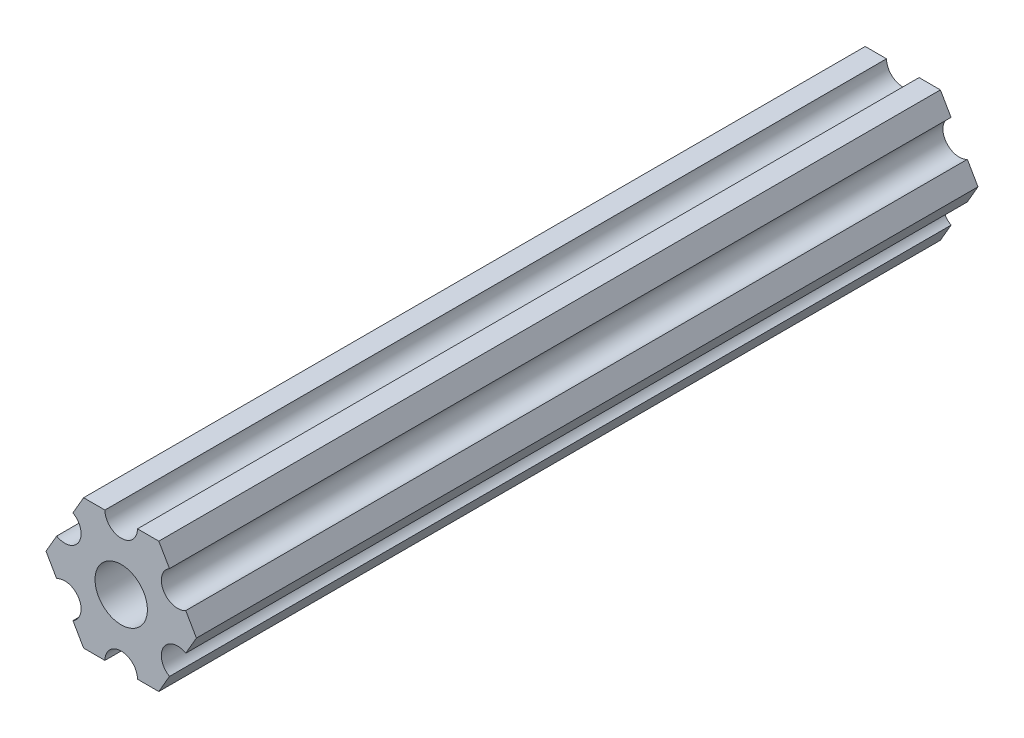
ISO-10303-21;
HEADER;
FILE_DESCRIPTION(('STEP AP214'),'2;1');
FILE_NAME('part.step','',(''),(''),'','','');
FILE_SCHEMA(('AUTOMOTIVE_DESIGN { 1 0 10303 214 1 1 1 1 }'));
ENDSEC;
DATA;
#1=APPLICATION_CONTEXT('core data for automotive mechanical design processes');
#2=APPLICATION_PROTOCOL_DEFINITION('international standard','automotive_design',2000,#1);
#3=PRODUCT_CONTEXT('',#1,'mechanical');
#4=PRODUCT('Part','Part','',(#3));
#5=PRODUCT_RELATED_PRODUCT_CATEGORY('part','',(#4));
#6=PRODUCT_DEFINITION_FORMATION('','',#4);
#7=PRODUCT_DEFINITION_CONTEXT('part definition',#1,'design');
#8=PRODUCT_DEFINITION('design','',#6,#7);
#9=PRODUCT_DEFINITION_SHAPE('','',#8);
#10=(LENGTH_UNIT() NAMED_UNIT(*) SI_UNIT(.MILLI.,.METRE.));
#11=(NAMED_UNIT(*) PLANE_ANGLE_UNIT() SI_UNIT($,.RADIAN.));
#12=(NAMED_UNIT(*) SI_UNIT($,.STERADIAN.) SOLID_ANGLE_UNIT());
#13=UNCERTAINTY_MEASURE_WITH_UNIT(LENGTH_MEASURE(1.E-05),#10,'distance_accuracy_value','');
#14=(GEOMETRIC_REPRESENTATION_CONTEXT(3) GLOBAL_UNCERTAINTY_ASSIGNED_CONTEXT((#13)) GLOBAL_UNIT_ASSIGNED_CONTEXT((#10,
#11,#12)) REPRESENTATION_CONTEXT('',''));
#15=CARTESIAN_POINT('',(0.,0.,0.));
#16=DIRECTION('',(0.,0.,1.));
#17=DIRECTION('',(1.,0.,0.));
#18=AXIS2_PLACEMENT_3D('',#15,#16,#17);
#19=CARTESIAN_POINT('',(-5.49926150638083,-3.17499966684068,0.));
#20=DIRECTION('',(0.,0.,-1.));
#21=DIRECTION('',(-1.,0.,0.));
#22=AXIS2_PLACEMENT_3D('',#19,#20,#21);
#23=PLANE('',#22);
#24=CARTESIAN_POINT('',(-5.49926150638083,-3.17499966684068,0.));
#25=DIRECTION('',(0.,0.,-1.));
#26=DIRECTION('',(-1.,0.,0.));
#27=AXIS2_PLACEMENT_3D('',#24,#25,#26);
#28=CIRCLE('',#27,1.58750000000001);
#29=CARTESIAN_POINT('',(-6.29301142309098,-1.80018429024546,0.));
#30=VERTEX_POINT('',#29);
#31=CARTESIAN_POINT('',(-4.70551158967068,-4.54981504343589,0.));
#32=VERTEX_POINT('',#31);
#33=EDGE_CURVE('E203',#30,#32,#28,.T.);
#34=ORIENTED_EDGE('',*,*,#33,.T.);
#35=DIRECTION('',(0.499999947533953,-0.866025434075723,0.));
#36=VECTOR('',#35,1.);
#37=CARTESIAN_POINT('',(-4.70551158967068,-4.54981504343589,0.));
#38=LINE('',#37,#36);
#39=CARTESIAN_POINT('',(-3.66617452134693,-6.34999990382519,0.));
#40=VERTEX_POINT('',#39);
#41=EDGE_CURVE('E206',#32,#40,#38,.T.);
#42=ORIENTED_EDGE('',*,*,#41,.T.);
#43=DIRECTION('',(1.,0.,0.));
#44=VECTOR('',#43,1.);
#45=CARTESIAN_POINT('',(-3.66617452134693,-6.34999990382519,0.));
#46=LINE('',#45,#44);
#47=CARTESIAN_POINT('',(-1.58750230819557,-6.34999990382519,0.));
#48=VERTEX_POINT('',#47);
#49=EDGE_CURVE('E210',#40,#48,#46,.T.);
#50=ORIENTED_EDGE('',*,*,#49,.T.);
#51=CARTESIAN_POINT('',(-3.8469926204343E-07,-6.34999990382519,0.));
#52=DIRECTION('',(0.,0.,-1.));
#53=DIRECTION('',(-1.,0.,0.));
#54=AXIS2_PLACEMENT_3D('',#51,#52,#53);
#55=CIRCLE('',#54,1.58750192349631);
#56=CARTESIAN_POINT('',(1.58750192349631,-6.34999990382519,0.));
#57=VERTEX_POINT('',#56);
#58=EDGE_CURVE('E213',#48,#57,#55,.T.);
#59=ORIENTED_EDGE('',*,*,#58,.T.);
#60=DIRECTION('',(1.,0.,0.));
#61=VECTOR('',#60,1.);
#62=CARTESIAN_POINT('',(1.58750192349631,-6.34999990382519,0.));
#63=LINE('',#62,#61);
#64=CARTESIAN_POINT('',(3.66617382465481,-6.34999990382519,0.));
#65=VERTEX_POINT('',#64);
#66=EDGE_CURVE('E216',#57,#65,#63,.T.);
#67=ORIENTED_EDGE('',*,*,#66,.T.);
#68=DIRECTION('',(0.5,0.866025403784439,0.));
#69=VECTOR('',#68,1.);
#70=CARTESIAN_POINT('',(3.66617382465481,-6.34999990382519,0.));
#71=LINE('',#70,#69);
#72=CARTESIAN_POINT('',(4.70551092933191,-4.54981523233291,0.));
#73=VERTEX_POINT('',#72);
#74=EDGE_CURVE('E219',#65,#73,#71,.T.);
#75=ORIENTED_EDGE('',*,*,#74,.T.);
#76=CARTESIAN_POINT('',(5.49926092933191,-3.17499990382512,0.));
#77=DIRECTION('',(0.,0.,-1.));
#78=DIRECTION('',(-1.,0.,0.));
#79=AXIS2_PLACEMENT_3D('',#76,#77,#78);
#80=CIRCLE('',#79,1.5875);
#81=CARTESIAN_POINT('',(6.29301092933191,-1.80018457531732,0.));
#82=VERTEX_POINT('',#81);
#83=EDGE_CURVE('E222',#73,#82,#80,.T.);
#84=ORIENTED_EDGE('',*,*,#83,.T.);
#85=DIRECTION('',(0.5,0.866025403784438,0.));
#86=VECTOR('',#85,1.);
#87=CARTESIAN_POINT('',(6.29301092933191,-1.80018457531732,0.));
#88=LINE('',#87,#86);
#89=CARTESIAN_POINT('',(7.33234803400895,9.61748368946088E-08,0.));
#90=VERTEX_POINT('',#89);
#91=EDGE_CURVE('E225',#82,#90,#88,.T.);
#92=ORIENTED_EDGE('',*,*,#91,.T.);
#93=DIRECTION('',(-0.499999921300922,0.866025449221368,0.));
#94=VECTOR('',#93,1.);
#95=CARTESIAN_POINT('',(7.33234803400895,9.61748368946088E-08,0.));
#96=LINE('',#95,#94);
#97=CARTESIAN_POINT('',(6.29301117773375,1.80018471521667,0.));
#98=VERTEX_POINT('',#97);
#99=EDGE_CURVE('E228',#90,#98,#96,.T.);
#100=ORIENTED_EDGE('',*,*,#99,.T.);
#101=CARTESIAN_POINT('',(5.49926130266854,3.1750001158556,0.));
#102=DIRECTION('',(0.,0.,-1.));
#103=DIRECTION('',(-1.,0.,0.));
#104=AXIS2_PLACEMENT_3D('',#101,#102,#103);
#105=CIRCLE('',#104,1.5875);
#106=CARTESIAN_POINT('',(4.70551142760333,4.54981551649452,0.));
#107=VERTEX_POINT('',#106);
#108=EDGE_CURVE('E231',#98,#107,#105,.T.);
#109=ORIENTED_EDGE('',*,*,#108,.T.);
#110=DIRECTION('',(-0.499999921300922,0.866025449221368,0.));
#111=VECTOR('',#110,1.);
#112=CARTESIAN_POINT('',(4.70551142760333,4.54981551649452,0.));
#113=LINE('',#112,#111);
#114=CARTESIAN_POINT('',(3.66617452134701,6.35000022210623,0.));
#115=VERTEX_POINT('',#114);
#116=EDGE_CURVE('E234',#107,#115,#113,.T.);
#117=ORIENTED_EDGE('',*,*,#116,.T.);
#118=DIRECTION('',(-1.,0.,0.));
#119=VECTOR('',#118,1.);
#120=CARTESIAN_POINT('',(3.66617452134701,6.35000022210623,0.));
#121=LINE('',#120,#119);
#122=CARTESIAN_POINT('',(1.58749846120262,6.35000022210623,0.));
#123=VERTEX_POINT('',#122);
#124=EDGE_CURVE('E237',#115,#123,#121,.T.);
#125=ORIENTED_EDGE('',*,*,#124,.T.);
#126=CARTESIAN_POINT('',(3.84699344941095E-07,6.35000022210623,0.));
#127=DIRECTION('',(0.,0.,-1.));
#128=DIRECTION('',(-1.,0.,0.));
#129=AXIS2_PLACEMENT_3D('',#126,#127,#128);
#130=CIRCLE('',#129,1.58749807650328);
#131=CARTESIAN_POINT('',(-1.58749807650328,6.35000022210623,0.));
#132=VERTEX_POINT('',#131);
#133=EDGE_CURVE('E240',#123,#132,#130,.T.);
#134=ORIENTED_EDGE('',*,*,#133,.T.);
#135=DIRECTION('',(-1.,0.,0.));
#136=VECTOR('',#135,1.);
#137=CARTESIAN_POINT('',(-1.58749807650328,6.35000022210623,0.));
#138=LINE('',#137,#136);
#139=CARTESIAN_POINT('',(-3.66617382465472,6.35000022210622,0.));
#140=VERTEX_POINT('',#139);
#141=EDGE_CURVE('E243',#132,#140,#138,.T.);
#142=ORIENTED_EDGE('',*,*,#141,.T.);
#143=DIRECTION('',(-0.500000052466056,-0.866025373493145,0.));
#144=VECTOR('',#143,1.);
#145=CARTESIAN_POINT('',(-3.66617382465472,6.35000022210622,0.));
#146=LINE('',#145,#144);
#147=CARTESIAN_POINT('',(-4.70551103839166,4.54981561357968,0.));
#148=VERTEX_POINT('',#147);
#149=EDGE_CURVE('E246',#140,#148,#146,.T.);
#150=ORIENTED_EDGE('',*,*,#149,.T.);
#151=CARTESIAN_POINT('',(-5.49926112168152,3.17500033315931,0.));
#152=DIRECTION('',(0.,0.,-1.));
#153=DIRECTION('',(-1.,0.,0.));
#154=AXIS2_PLACEMENT_3D('',#151,#152,#153);
#155=CIRCLE('',#154,1.5875);
#156=CARTESIAN_POINT('',(-6.29301120497139,1.80018505273895,0.));
#157=VERTEX_POINT('',#156);
#158=EDGE_CURVE('E249',#148,#157,#155,.T.);
#159=ORIENTED_EDGE('',*,*,#158,.T.);
#160=DIRECTION('',(-0.500000052466056,-0.866025373493145,0.));
#161=VECTOR('',#160,1.);
#162=CARTESIAN_POINT('',(-6.29301120497139,1.80018505273895,0.));
#163=LINE('',#162,#161);
#164=CARTESIAN_POINT('',(-7.33234841870826,4.44212518856872E-07,0.));
#165=VERTEX_POINT('',#164);
#166=EDGE_CURVE('E180',#157,#165,#163,.T.);
#167=ORIENTED_EDGE('',*,*,#166,.T.);
#168=DIRECTION('',(0.499999947533953,-0.866025434075723,0.));
#169=VECTOR('',#168,1.);
#170=CARTESIAN_POINT('',(-7.33234841870826,4.44212518856872E-07,0.));
#171=LINE('',#170,#169);
#172=EDGE_CURVE('E252',#165,#30,#171,.T.);
#173=ORIENTED_EDGE('',*,*,#172,.T.);
#174=EDGE_LOOP('',(#34,#42,#50,#59,#67,#75,#84,#92,#100,#109,#117,#125,#134,#142,#150,#159,#167,#173));
#175=FACE_BOUND('',#174,.T.);
#176=CARTESIAN_POINT('',(0.,0.,0.));
#177=DIRECTION('',(0.,0.,1.));
#178=DIRECTION('',(1.,0.,0.));
#179=AXIS2_PLACEMENT_3D('',#176,#177,#178);
#180=CIRCLE('',#179,2.55269999999999);
#181=CARTESIAN_POINT('',(2.55269999999999,0.,0.));
#182=VERTEX_POINT('',#181);
#183=EDGE_CURVE('E313',#182,#182,#180,.T.);
#184=ORIENTED_EDGE('',*,*,#183,.F.);
#185=EDGE_LOOP('',(#184));
#186=FACE_BOUND('',#185,.T.);
#187=ADVANCED_FACE('F45',(#175,#186),#23,.F.);
#188=CARTESIAN_POINT('',(-5.49926150638083,-3.17499966684068,-76.2));
#189=DIRECTION('',(0.,0.,1.));
#190=DIRECTION('',(1.,0.,0.));
#191=AXIS2_PLACEMENT_3D('',#188,#189,#190);
#192=CYLINDRICAL_SURFACE('',#191,1.58750000000001);
#193=ORIENTED_EDGE('',*,*,#33,.F.);
#194=DIRECTION('',(0.,0.,1.));
#195=VECTOR('',#194,1.);
#196=CARTESIAN_POINT('',(-6.29301142309098,-1.80018429024546,-76.2));
#197=LINE('',#196,#195);
#198=CARTESIAN_POINT('',(-6.29301142309098,-1.80018429024546,-76.2));
#199=VERTEX_POINT('',#198);
#200=EDGE_CURVE('E11',#199,#30,#197,.T.);
#201=ORIENTED_EDGE('',*,*,#200,.F.);
#202=CARTESIAN_POINT('',(-5.49926150638083,-3.17499966684068,-76.2));
#203=DIRECTION('',(0.,0.,-1.));
#204=DIRECTION('',(-1.,0.,0.));
#205=AXIS2_PLACEMENT_3D('',#202,#203,#204);
#206=CIRCLE('',#205,1.58750000000001);
#207=CARTESIAN_POINT('',(-4.70551158967068,-4.54981504343589,-76.2));
#208=VERTEX_POINT('',#207);
#209=EDGE_CURVE('E254',#199,#208,#206,.T.);
#210=ORIENTED_EDGE('',*,*,#209,.T.);
#211=DIRECTION('',(0.,0.,1.));
#212=VECTOR('',#211,1.);
#213=CARTESIAN_POINT('',(-4.70551158967068,-4.54981504343589,-76.2));
#214=LINE('',#213,#212);
#215=EDGE_CURVE('E49',#208,#32,#214,.T.);
#216=ORIENTED_EDGE('',*,*,#215,.T.);
#217=EDGE_LOOP('',(#193,#201,#210,#216));
#218=FACE_BOUND('',#217,.T.);
#219=ADVANCED_FACE('F47',(#218),#192,.F.);
#220=CARTESIAN_POINT('',(-7.33234841870826,4.44212518856872E-07,-76.2));
#221=DIRECTION('',(-0.866025434075723,-0.499999947533953,0.));
#222=DIRECTION('',(0.499999947533953,-0.866025434075723,0.));
#223=AXIS2_PLACEMENT_3D('',#220,#221,#222);
#224=PLANE('',#223);
#225=ORIENTED_EDGE('',*,*,#172,.F.);
#226=DIRECTION('',(0.,0.,1.));
#227=VECTOR('',#226,1.);
#228=CARTESIAN_POINT('',(-7.33234841870826,4.44212518856872E-07,-76.2));
#229=LINE('',#228,#227);
#230=CARTESIAN_POINT('',(-7.33234841870826,4.44212518856872E-07,-76.2));
#231=VERTEX_POINT('',#230);
#232=EDGE_CURVE('E55',#231,#165,#229,.T.);
#233=ORIENTED_EDGE('',*,*,#232,.F.);
#234=DIRECTION('',(0.499999947533953,-0.866025434075723,0.));
#235=VECTOR('',#234,1.);
#236=CARTESIAN_POINT('',(-7.33234841870826,4.44212518856872E-07,-76.2));
#237=LINE('',#236,#235);
#238=EDGE_CURVE('E193',#231,#199,#237,.T.);
#239=ORIENTED_EDGE('',*,*,#238,.T.);
#240=ORIENTED_EDGE('',*,*,#200,.T.);
#241=EDGE_LOOP('',(#225,#233,#239,#240));
#242=FACE_BOUND('',#241,.T.);
#243=ADVANCED_FACE('F286',(#242),#224,.T.);
#244=CARTESIAN_POINT('',(-6.29301120497139,1.80018505273895,-76.2));
#245=DIRECTION('',(-0.866025373493145,0.500000052466056,0.));
#246=DIRECTION('',(-0.500000052466056,-0.866025373493145,0.));
#247=AXIS2_PLACEMENT_3D('',#244,#245,#246);
#248=PLANE('',#247);
#249=ORIENTED_EDGE('',*,*,#166,.F.);
#250=DIRECTION('',(0.,0.,1.));
#251=VECTOR('',#250,1.);
#252=CARTESIAN_POINT('',(-6.29301120497139,1.80018505273895,-76.2));
#253=LINE('',#252,#251);
#254=CARTESIAN_POINT('',(-6.29301120497139,1.80018505273895,-76.2));
#255=VERTEX_POINT('',#254);
#256=EDGE_CURVE('E175',#255,#157,#253,.T.);
#257=ORIENTED_EDGE('',*,*,#256,.F.);
#258=DIRECTION('',(-0.500000052466056,-0.866025373493145,0.));
#259=VECTOR('',#258,1.);
#260=CARTESIAN_POINT('',(-6.29301120497139,1.80018505273895,-76.2));
#261=LINE('',#260,#259);
#262=EDGE_CURVE('E178',#255,#231,#261,.T.);
#263=ORIENTED_EDGE('',*,*,#262,.T.);
#264=ORIENTED_EDGE('',*,*,#232,.T.);
#265=EDGE_LOOP('',(#249,#257,#263,#264));
#266=FACE_BOUND('',#265,.T.);
#267=ADVANCED_FACE('F177',(#266),#248,.T.);
#268=CARTESIAN_POINT('',(-5.49926112168152,3.17500033315931,-76.2));
#269=DIRECTION('',(0.,0.,1.));
#270=DIRECTION('',(1.,0.,0.));
#271=AXIS2_PLACEMENT_3D('',#268,#269,#270);
#272=CYLINDRICAL_SURFACE('',#271,1.5875);
#273=ORIENTED_EDGE('',*,*,#158,.F.);
#274=DIRECTION('',(0.,0.,1.));
#275=VECTOR('',#274,1.);
#276=CARTESIAN_POINT('',(-4.70551103839166,4.54981561357968,-76.2));
#277=LINE('',#276,#275);
#278=CARTESIAN_POINT('',(-4.70551103839166,4.54981561357968,-76.2));
#279=VERTEX_POINT('',#278);
#280=EDGE_CURVE('E185',#279,#148,#277,.T.);
#281=ORIENTED_EDGE('',*,*,#280,.F.);
#282=CARTESIAN_POINT('',(-5.49926112168152,3.17500033315931,-76.2));
#283=DIRECTION('',(0.,0.,-1.));
#284=DIRECTION('',(-1.,0.,0.));
#285=AXIS2_PLACEMENT_3D('',#282,#283,#284);
#286=CIRCLE('',#285,1.5875);
#287=EDGE_CURVE('E191',#279,#255,#286,.T.);
#288=ORIENTED_EDGE('',*,*,#287,.T.);
#289=ORIENTED_EDGE('',*,*,#256,.T.);
#290=EDGE_LOOP('',(#273,#281,#288,#289));
#291=FACE_BOUND('',#290,.T.);
#292=ADVANCED_FACE('F195',(#291),#272,.F.);
#293=CARTESIAN_POINT('',(-3.66617382465472,6.35000022210622,-76.2));
#294=DIRECTION('',(-0.866025373493145,0.500000052466056,0.));
#295=DIRECTION('',(-0.500000052466056,-0.866025373493145,0.));
#296=AXIS2_PLACEMENT_3D('',#293,#294,#295);
#297=PLANE('',#296);
#298=ORIENTED_EDGE('',*,*,#149,.F.);
#299=DIRECTION('',(0.,0.,1.));
#300=VECTOR('',#299,1.);
#301=CARTESIAN_POINT('',(-3.66617382465472,6.35000022210622,-76.2));
#302=LINE('',#301,#300);
#303=CARTESIAN_POINT('',(-3.66617382465472,6.35000022210622,-76.2));
#304=VERTEX_POINT('',#303);
#305=EDGE_CURVE('E258',#304,#140,#302,.T.);
#306=ORIENTED_EDGE('',*,*,#305,.F.);
#307=DIRECTION('',(-0.500000052466056,-0.866025373493145,0.));
#308=VECTOR('',#307,1.);
#309=CARTESIAN_POINT('',(-3.66617382465472,6.35000022210622,-76.2));
#310=LINE('',#309,#308);
#311=EDGE_CURVE('E196',#304,#279,#310,.T.);
#312=ORIENTED_EDGE('',*,*,#311,.T.);
#313=ORIENTED_EDGE('',*,*,#280,.T.);
#314=EDGE_LOOP('',(#298,#306,#312,#313));
#315=FACE_BOUND('',#314,.T.);
#316=ADVANCED_FACE('F402',(#315),#297,.T.);
#317=CARTESIAN_POINT('',(-1.58749807650328,6.35000022210623,-76.2));
#318=DIRECTION('',(0.,1.,0.));
#319=DIRECTION('',(-1.,0.,0.));
#320=AXIS2_PLACEMENT_3D('',#317,#318,#319);
#321=PLANE('',#320);
#322=ORIENTED_EDGE('',*,*,#141,.F.);
#323=DIRECTION('',(0.,0.,1.));
#324=VECTOR('',#323,1.);
#325=CARTESIAN_POINT('',(-1.58749807650328,6.35000022210623,-76.2));
#326=LINE('',#325,#324);
#327=CARTESIAN_POINT('',(-1.58749807650328,6.35000022210623,-76.2));
#328=VERTEX_POINT('',#327);
#329=EDGE_CURVE('E260',#328,#132,#326,.T.);
#330=ORIENTED_EDGE('',*,*,#329,.F.);
#331=DIRECTION('',(-1.,0.,0.));
#332=VECTOR('',#331,1.);
#333=CARTESIAN_POINT('',(-1.58749807650328,6.35000022210623,-76.2));
#334=LINE('',#333,#332);
#335=EDGE_CURVE('E198',#328,#304,#334,.T.);
#336=ORIENTED_EDGE('',*,*,#335,.T.);
#337=ORIENTED_EDGE('',*,*,#305,.T.);
#338=EDGE_LOOP('',(#322,#330,#336,#337));
#339=FACE_BOUND('',#338,.T.);
#340=ADVANCED_FACE('F356',(#339),#321,.T.);
#341=CARTESIAN_POINT('',(3.84699344941095E-07,6.35000022210623,-76.2));
#342=DIRECTION('',(0.,0.,1.));
#343=DIRECTION('',(1.,0.,0.));
#344=AXIS2_PLACEMENT_3D('',#341,#342,#343);
#345=CYLINDRICAL_SURFACE('',#344,1.58749807650328);
#346=ORIENTED_EDGE('',*,*,#133,.F.);
#347=DIRECTION('',(0.,0.,1.));
#348=VECTOR('',#347,1.);
#349=CARTESIAN_POINT('',(1.58749846120262,6.35000022210623,-76.2));
#350=LINE('',#349,#348);
#351=CARTESIAN_POINT('',(1.58749846120262,6.35000022210623,-76.2));
#352=VERTEX_POINT('',#351);
#353=EDGE_CURVE('E262',#352,#123,#350,.T.);
#354=ORIENTED_EDGE('',*,*,#353,.F.);
#355=CARTESIAN_POINT('',(3.84699344941095E-07,6.35000022210623,-76.2));
#356=DIRECTION('',(0.,0.,-1.));
#357=DIRECTION('',(-1.,0.,0.));
#358=AXIS2_PLACEMENT_3D('',#355,#356,#357);
#359=CIRCLE('',#358,1.58749807650328);
#360=EDGE_CURVE('E350',#352,#328,#359,.T.);
#361=ORIENTED_EDGE('',*,*,#360,.T.);
#362=ORIENTED_EDGE('',*,*,#329,.T.);
#363=EDGE_LOOP('',(#346,#354,#361,#362));
#364=FACE_BOUND('',#363,.T.);
#365=ADVANCED_FACE('F362',(#364),#345,.F.);
#366=CARTESIAN_POINT('',(3.66617452134701,6.35000022210623,-76.2));
#367=DIRECTION('',(0.,1.,0.));
#368=DIRECTION('',(-1.,0.,0.));
#369=AXIS2_PLACEMENT_3D('',#366,#367,#368);
#370=PLANE('',#369);
#371=ORIENTED_EDGE('',*,*,#124,.F.);
#372=DIRECTION('',(0.,0.,1.));
#373=VECTOR('',#372,1.);
#374=CARTESIAN_POINT('',(3.66617452134701,6.35000022210623,-76.2));
#375=LINE('',#374,#373);
#376=CARTESIAN_POINT('',(3.66617452134701,6.35000022210623,-76.2));
#377=VERTEX_POINT('',#376);
#378=EDGE_CURVE('E264',#377,#115,#375,.T.);
#379=ORIENTED_EDGE('',*,*,#378,.F.);
#380=DIRECTION('',(-1.,0.,0.));
#381=VECTOR('',#380,1.);
#382=CARTESIAN_POINT('',(3.66617452134701,6.35000022210623,-76.2));
#383=LINE('',#382,#381);
#384=EDGE_CURVE('E347',#377,#352,#383,.T.);
#385=ORIENTED_EDGE('',*,*,#384,.T.);
#386=ORIENTED_EDGE('',*,*,#353,.T.);
#387=EDGE_LOOP('',(#371,#379,#385,#386));
#388=FACE_BOUND('',#387,.T.);
#389=ADVANCED_FACE('F365',(#388),#370,.T.);
#390=CARTESIAN_POINT('',(4.70551142760333,4.54981551649452,-76.2));
#391=DIRECTION('',(0.866025449221368,0.499999921300922,0.));
#392=DIRECTION('',(-0.499999921300922,0.866025449221368,0.));
#393=AXIS2_PLACEMENT_3D('',#390,#391,#392);
#394=PLANE('',#393);
#395=ORIENTED_EDGE('',*,*,#116,.F.);
#396=DIRECTION('',(0.,0.,1.));
#397=VECTOR('',#396,1.);
#398=CARTESIAN_POINT('',(4.70551142760333,4.54981551649452,-76.2));
#399=LINE('',#398,#397);
#400=CARTESIAN_POINT('',(4.70551142760333,4.54981551649452,-76.2));
#401=VERTEX_POINT('',#400);
#402=EDGE_CURVE('E266',#401,#107,#399,.T.);
#403=ORIENTED_EDGE('',*,*,#402,.F.);
#404=DIRECTION('',(-0.499999921300922,0.866025449221368,0.));
#405=VECTOR('',#404,1.);
#406=CARTESIAN_POINT('',(4.70551142760333,4.54981551649452,-76.2));
#407=LINE('',#406,#405);
#408=EDGE_CURVE('E344',#401,#377,#407,.T.);
#409=ORIENTED_EDGE('',*,*,#408,.T.);
#410=ORIENTED_EDGE('',*,*,#378,.T.);
#411=EDGE_LOOP('',(#395,#403,#409,#410));
#412=FACE_BOUND('',#411,.T.);
#413=ADVANCED_FACE('F370',(#412),#394,.T.);
#414=CARTESIAN_POINT('',(5.49926130266854,3.1750001158556,-76.2));
#415=DIRECTION('',(0.,0.,1.));
#416=DIRECTION('',(1.,0.,0.));
#417=AXIS2_PLACEMENT_3D('',#414,#415,#416);
#418=CYLINDRICAL_SURFACE('',#417,1.5875);
#419=ORIENTED_EDGE('',*,*,#108,.F.);
#420=DIRECTION('',(0.,0.,1.));
#421=VECTOR('',#420,1.);
#422=CARTESIAN_POINT('',(6.29301117773375,1.80018471521667,-76.2));
#423=LINE('',#422,#421);
#424=CARTESIAN_POINT('',(6.29301117773375,1.80018471521667,-76.2));
#425=VERTEX_POINT('',#424);
#426=EDGE_CURVE('E268',#425,#98,#423,.T.);
#427=ORIENTED_EDGE('',*,*,#426,.F.);
#428=CARTESIAN_POINT('',(5.49926130266854,3.1750001158556,-76.2));
#429=DIRECTION('',(0.,0.,-1.));
#430=DIRECTION('',(-1.,0.,0.));
#431=AXIS2_PLACEMENT_3D('',#428,#429,#430);
#432=CIRCLE('',#431,1.5875);
#433=EDGE_CURVE('E341',#425,#401,#432,.T.);
#434=ORIENTED_EDGE('',*,*,#433,.T.);
#435=ORIENTED_EDGE('',*,*,#402,.T.);
#436=EDGE_LOOP('',(#419,#427,#434,#435));
#437=FACE_BOUND('',#436,.T.);
#438=ADVANCED_FACE('F373',(#437),#418,.F.);
#439=CARTESIAN_POINT('',(7.33234803400895,9.61748368946088E-08,-76.2));
#440=DIRECTION('',(0.866025449221368,0.499999921300922,0.));
#441=DIRECTION('',(-0.499999921300922,0.866025449221368,0.));
#442=AXIS2_PLACEMENT_3D('',#439,#440,#441);
#443=PLANE('',#442);
#444=ORIENTED_EDGE('',*,*,#99,.F.);
#445=DIRECTION('',(0.,0.,1.));
#446=VECTOR('',#445,1.);
#447=CARTESIAN_POINT('',(7.33234803400895,9.61748368946088E-08,-76.2));
#448=LINE('',#447,#446);
#449=CARTESIAN_POINT('',(7.33234803400895,9.61748368946088E-08,-76.2));
#450=VERTEX_POINT('',#449);
#451=EDGE_CURVE('E270',#450,#90,#448,.T.);
#452=ORIENTED_EDGE('',*,*,#451,.F.);
#453=DIRECTION('',(-0.499999921300922,0.866025449221368,0.));
#454=VECTOR('',#453,1.);
#455=CARTESIAN_POINT('',(7.33234803400895,9.61748368946088E-08,-76.2));
#456=LINE('',#455,#454);
#457=EDGE_CURVE('E338',#450,#425,#456,.T.);
#458=ORIENTED_EDGE('',*,*,#457,.T.);
#459=ORIENTED_EDGE('',*,*,#426,.T.);
#460=EDGE_LOOP('',(#444,#452,#458,#459));
#461=FACE_BOUND('',#460,.T.);
#462=ADVANCED_FACE('F378',(#461),#443,.T.);
#463=CARTESIAN_POINT('',(6.29301092933191,-1.80018457531732,-76.2));
#464=DIRECTION('',(0.866025403784438,-0.5,0.));
#465=DIRECTION('',(0.5,0.866025403784438,0.));
#466=AXIS2_PLACEMENT_3D('',#463,#464,#465);
#467=PLANE('',#466);
#468=ORIENTED_EDGE('',*,*,#91,.F.);
#469=DIRECTION('',(0.,0.,1.));
#470=VECTOR('',#469,1.);
#471=CARTESIAN_POINT('',(6.29301092933191,-1.80018457531732,-76.2));
#472=LINE('',#471,#470);
#473=CARTESIAN_POINT('',(6.29301092933191,-1.80018457531732,-76.2));
#474=VERTEX_POINT('',#473);
#475=EDGE_CURVE('E272',#474,#82,#472,.T.);
#476=ORIENTED_EDGE('',*,*,#475,.F.);
#477=DIRECTION('',(0.5,0.866025403784438,0.));
#478=VECTOR('',#477,1.);
#479=CARTESIAN_POINT('',(6.29301092933191,-1.80018457531732,-76.2));
#480=LINE('',#479,#478);
#481=EDGE_CURVE('E335',#474,#450,#480,.T.);
#482=ORIENTED_EDGE('',*,*,#481,.T.);
#483=ORIENTED_EDGE('',*,*,#451,.T.);
#484=EDGE_LOOP('',(#468,#476,#482,#483));
#485=FACE_BOUND('',#484,.T.);
#486=ADVANCED_FACE('F381',(#485),#467,.T.);
#487=CARTESIAN_POINT('',(5.49926092933191,-3.17499990382512,-76.2));
#488=DIRECTION('',(0.,0.,1.));
#489=DIRECTION('',(1.,0.,0.));
#490=AXIS2_PLACEMENT_3D('',#487,#488,#489);
#491=CYLINDRICAL_SURFACE('',#490,1.5875);
#492=ORIENTED_EDGE('',*,*,#83,.F.);
#493=DIRECTION('',(0.,0.,1.));
#494=VECTOR('',#493,1.);
#495=CARTESIAN_POINT('',(4.70551092933191,-4.54981523233291,-76.2));
#496=LINE('',#495,#494);
#497=CARTESIAN_POINT('',(4.70551092933191,-4.54981523233291,-76.2));
#498=VERTEX_POINT('',#497);
#499=EDGE_CURVE('E274',#498,#73,#496,.T.);
#500=ORIENTED_EDGE('',*,*,#499,.F.);
#501=CARTESIAN_POINT('',(5.49926092933191,-3.17499990382512,-76.2));
#502=DIRECTION('',(0.,0.,-1.));
#503=DIRECTION('',(-1.,0.,0.));
#504=AXIS2_PLACEMENT_3D('',#501,#502,#503);
#505=CIRCLE('',#504,1.5875);
#506=EDGE_CURVE('E332',#498,#474,#505,.T.);
#507=ORIENTED_EDGE('',*,*,#506,.T.);
#508=ORIENTED_EDGE('',*,*,#475,.T.);
#509=EDGE_LOOP('',(#492,#500,#507,#508));
#510=FACE_BOUND('',#509,.T.);
#511=ADVANCED_FACE('F386',(#510),#491,.F.);
#512=CARTESIAN_POINT('',(3.66617382465481,-6.34999990382519,-76.2));
#513=DIRECTION('',(0.866025403784439,-0.5,0.));
#514=DIRECTION('',(0.5,0.866025403784438,0.));
#515=AXIS2_PLACEMENT_3D('',#512,#513,#514);
#516=PLANE('',#515);
#517=ORIENTED_EDGE('',*,*,#74,.F.);
#518=DIRECTION('',(0.,0.,1.));
#519=VECTOR('',#518,1.);
#520=CARTESIAN_POINT('',(3.66617382465481,-6.34999990382519,-76.2));
#521=LINE('',#520,#519);
#522=CARTESIAN_POINT('',(3.66617382465481,-6.34999990382519,-76.2));
#523=VERTEX_POINT('',#522);
#524=EDGE_CURVE('E276',#523,#65,#521,.T.);
#525=ORIENTED_EDGE('',*,*,#524,.F.);
#526=DIRECTION('',(0.5,0.866025403784439,0.));
#527=VECTOR('',#526,1.);
#528=CARTESIAN_POINT('',(3.66617382465481,-6.34999990382519,-76.2));
#529=LINE('',#528,#527);
#530=EDGE_CURVE('E329',#523,#498,#529,.T.);
#531=ORIENTED_EDGE('',*,*,#530,.T.);
#532=ORIENTED_EDGE('',*,*,#499,.T.);
#533=EDGE_LOOP('',(#517,#525,#531,#532));
#534=FACE_BOUND('',#533,.T.);
#535=ADVANCED_FACE('F389',(#534),#516,.T.);
#536=CARTESIAN_POINT('',(1.58750192349631,-6.34999990382519,-76.2));
#537=DIRECTION('',(0.,-1.,0.));
#538=DIRECTION('',(1.,0.,0.));
#539=AXIS2_PLACEMENT_3D('',#536,#537,#538);
#540=PLANE('',#539);
#541=ORIENTED_EDGE('',*,*,#66,.F.);
#542=DIRECTION('',(0.,0.,1.));
#543=VECTOR('',#542,1.);
#544=CARTESIAN_POINT('',(1.58750192349631,-6.34999990382519,-76.2));
#545=LINE('',#544,#543);
#546=CARTESIAN_POINT('',(1.58750192349631,-6.34999990382519,-76.2));
#547=VERTEX_POINT('',#546);
#548=EDGE_CURVE('E278',#547,#57,#545,.T.);
#549=ORIENTED_EDGE('',*,*,#548,.F.);
#550=DIRECTION('',(1.,0.,0.));
#551=VECTOR('',#550,1.);
#552=CARTESIAN_POINT('',(1.58750192349631,-6.34999990382519,-76.2));
#553=LINE('',#552,#551);
#554=EDGE_CURVE('E326',#547,#523,#553,.T.);
#555=ORIENTED_EDGE('',*,*,#554,.T.);
#556=ORIENTED_EDGE('',*,*,#524,.T.);
#557=EDGE_LOOP('',(#541,#549,#555,#556));
#558=FACE_BOUND('',#557,.T.);
#559=ADVANCED_FACE('F394',(#558),#540,.T.);
#560=CARTESIAN_POINT('',(-3.8469926204343E-07,-6.34999990382519,-76.2));
#561=DIRECTION('',(0.,0.,1.));
#562=DIRECTION('',(1.,0.,0.));
#563=AXIS2_PLACEMENT_3D('',#560,#561,#562);
#564=CYLINDRICAL_SURFACE('',#563,1.58750192349631);
#565=ORIENTED_EDGE('',*,*,#58,.F.);
#566=DIRECTION('',(0.,0.,1.));
#567=VECTOR('',#566,1.);
#568=CARTESIAN_POINT('',(-1.58750230819557,-6.34999990382519,-76.2));
#569=LINE('',#568,#567);
#570=CARTESIAN_POINT('',(-1.58750230819557,-6.34999990382519,-76.2));
#571=VERTEX_POINT('',#570);
#572=EDGE_CURVE('E280',#571,#48,#569,.T.);
#573=ORIENTED_EDGE('',*,*,#572,.F.);
#574=CARTESIAN_POINT('',(-3.8469926204343E-07,-6.34999990382519,-76.2));
#575=DIRECTION('',(0.,0.,-1.));
#576=DIRECTION('',(-1.,0.,0.));
#577=AXIS2_PLACEMENT_3D('',#574,#575,#576);
#578=CIRCLE('',#577,1.58750192349631);
#579=EDGE_CURVE('E323',#571,#547,#578,.T.);
#580=ORIENTED_EDGE('',*,*,#579,.T.);
#581=ORIENTED_EDGE('',*,*,#548,.T.);
#582=EDGE_LOOP('',(#565,#573,#580,#581));
#583=FACE_BOUND('',#582,.T.);
#584=ADVANCED_FACE('F397',(#583),#564,.F.);
#585=CARTESIAN_POINT('',(-3.66617452134693,-6.34999990382519,-76.2));
#586=DIRECTION('',(0.,-1.,0.));
#587=DIRECTION('',(1.,0.,0.));
#588=AXIS2_PLACEMENT_3D('',#585,#586,#587);
#589=PLANE('',#588);
#590=ORIENTED_EDGE('',*,*,#49,.F.);
#591=DIRECTION('',(0.,0.,1.));
#592=VECTOR('',#591,1.);
#593=CARTESIAN_POINT('',(-3.66617452134693,-6.34999990382519,-76.2));
#594=LINE('',#593,#592);
#595=CARTESIAN_POINT('',(-3.66617452134693,-6.34999990382519,-76.2));
#596=VERTEX_POINT('',#595);
#597=EDGE_CURVE('E281',#596,#40,#594,.T.);
#598=ORIENTED_EDGE('',*,*,#597,.F.);
#599=DIRECTION('',(1.,0.,0.));
#600=VECTOR('',#599,1.);
#601=CARTESIAN_POINT('',(-3.66617452134693,-6.34999990382519,-76.2));
#602=LINE('',#601,#600);
#603=EDGE_CURVE('E320',#596,#571,#602,.T.);
#604=ORIENTED_EDGE('',*,*,#603,.T.);
#605=ORIENTED_EDGE('',*,*,#572,.T.);
#606=EDGE_LOOP('',(#590,#598,#604,#605));
#607=FACE_BOUND('',#606,.T.);
#608=ADVANCED_FACE('F400',(#607),#589,.T.);
#609=CARTESIAN_POINT('',(-4.70551158967068,-4.54981504343589,-76.2));
#610=DIRECTION('',(-0.866025434075723,-0.499999947533953,0.));
#611=DIRECTION('',(0.499999947533953,-0.866025434075723,0.));
#612=AXIS2_PLACEMENT_3D('',#609,#610,#611);
#613=PLANE('',#612);
#614=ORIENTED_EDGE('',*,*,#41,.F.);
#615=ORIENTED_EDGE('',*,*,#215,.F.);
#616=DIRECTION('',(0.499999947533953,-0.866025434075723,0.));
#617=VECTOR('',#616,1.);
#618=CARTESIAN_POINT('',(-4.70551158967068,-4.54981504343589,-76.2));
#619=LINE('',#618,#617);
#620=EDGE_CURVE('E318',#208,#596,#619,.T.);
#621=ORIENTED_EDGE('',*,*,#620,.T.);
#622=ORIENTED_EDGE('',*,*,#597,.T.);
#623=EDGE_LOOP('',(#614,#615,#621,#622));
#624=FACE_BOUND('',#623,.T.);
#625=ADVANCED_FACE('F283',(#624),#613,.T.);
#626=CARTESIAN_POINT('',(-5.49926150638083,-3.17499966684068,-76.2));
#627=DIRECTION('',(0.,0.,-1.));
#628=DIRECTION('',(-1.,0.,0.));
#629=AXIS2_PLACEMENT_3D('',#626,#627,#628);
#630=PLANE('',#629);
#631=CARTESIAN_POINT('',(0.,0.,-76.2));
#632=DIRECTION('',(0.,0.,1.));
#633=DIRECTION('',(1.,0.,0.));
#634=AXIS2_PLACEMENT_3D('',#631,#632,#633);
#635=CIRCLE('',#634,2.55269999999998);
#636=CARTESIAN_POINT('',(2.55269999999998,0.,-76.2));
#637=VERTEX_POINT('',#636);
#638=EDGE_CURVE('E207',#637,#637,#635,.T.);
#639=ORIENTED_EDGE('',*,*,#638,.T.);
#640=EDGE_LOOP('',(#639));
#641=FACE_BOUND('',#640,.T.);
#642=ORIENTED_EDGE('',*,*,#209,.F.);
#643=ORIENTED_EDGE('',*,*,#238,.F.);
#644=ORIENTED_EDGE('',*,*,#262,.F.);
#645=ORIENTED_EDGE('',*,*,#287,.F.);
#646=ORIENTED_EDGE('',*,*,#311,.F.);
#647=ORIENTED_EDGE('',*,*,#335,.F.);
#648=ORIENTED_EDGE('',*,*,#360,.F.);
#649=ORIENTED_EDGE('',*,*,#384,.F.);
#650=ORIENTED_EDGE('',*,*,#408,.F.);
#651=ORIENTED_EDGE('',*,*,#433,.F.);
#652=ORIENTED_EDGE('',*,*,#457,.F.);
#653=ORIENTED_EDGE('',*,*,#481,.F.);
#654=ORIENTED_EDGE('',*,*,#506,.F.);
#655=ORIENTED_EDGE('',*,*,#530,.F.);
#656=ORIENTED_EDGE('',*,*,#554,.F.);
#657=ORIENTED_EDGE('',*,*,#579,.F.);
#658=ORIENTED_EDGE('',*,*,#603,.F.);
#659=ORIENTED_EDGE('',*,*,#620,.F.);
#660=EDGE_LOOP('',(#642,#643,#644,#645,#646,#647,#648,#649,#650,#651,#652,#653,#654,#655,#656,
#657,#658,#659));
#661=FACE_BOUND('',#660,.T.);
#662=ADVANCED_FACE('F189',(#641,#661),#630,.T.);
#663=CARTESIAN_POINT('',(0.,0.,0.));
#664=DIRECTION('',(0.,0.,1.));
#665=DIRECTION('',(1.,0.,0.));
#666=AXIS2_PLACEMENT_3D('',#663,#664,#665);
#667=CYLINDRICAL_SURFACE('',#666,2.55269999999998);
#668=ORIENTED_EDGE('',*,*,#638,.F.);
#669=EDGE_LOOP('',(#668));
#670=FACE_BOUND('',#669,.T.);
#671=ORIENTED_EDGE('',*,*,#183,.T.);
#672=EDGE_LOOP('',(#671));
#673=FACE_BOUND('',#672,.T.);
#674=ADVANCED_FACE('F302',(#670,#673),#667,.F.);
#675=CLOSED_SHELL('',(#187,#219,#243,#267,#292,#316,#340,#365,#389,#413,#438,#462,#486,#511,
#535,#559,#584,#608,#625,#662,#674));
#676=MANIFOLD_SOLID_BREP('B2',#675);
#677=ADVANCED_BREP_SHAPE_REPRESENTATION('',(#18,#676),#14);
#678=SHAPE_DEFINITION_REPRESENTATION(#9,#677);
ENDSEC;
END-ISO-10303-21;
